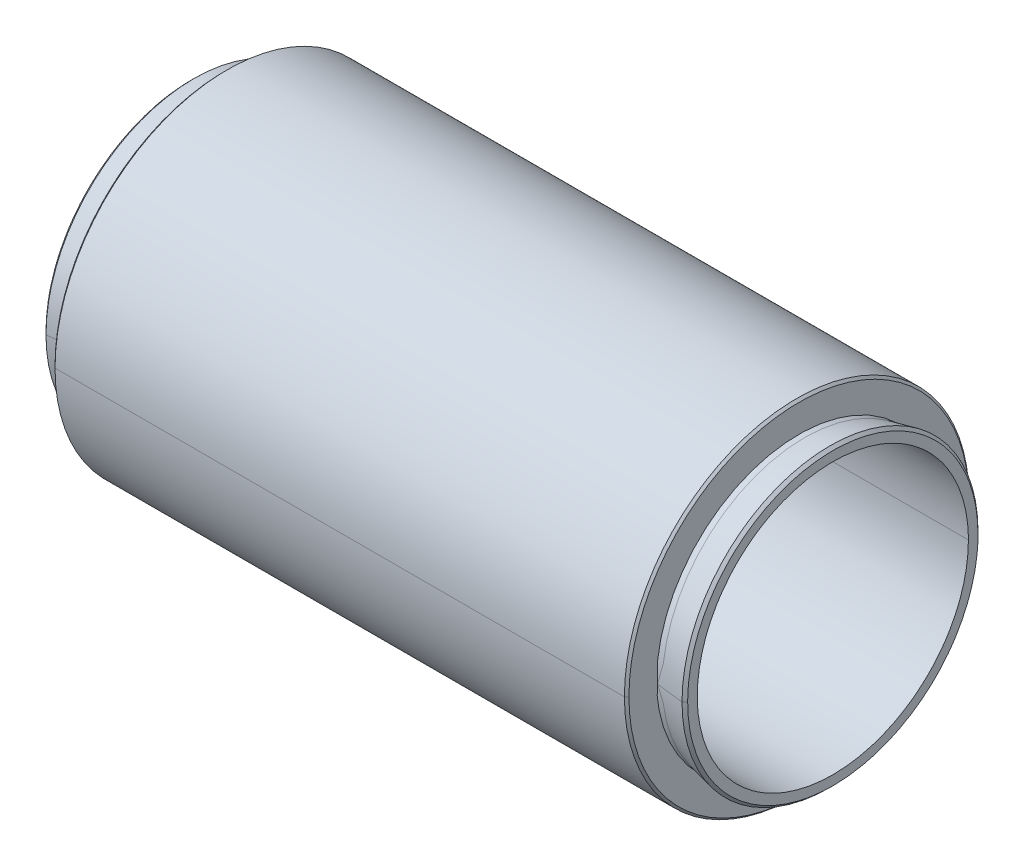
ISO-10303-21;
HEADER;
FILE_DESCRIPTION(('STEP AP214'),'2;1');
FILE_NAME('part.step','',(''),(''),'','','');
FILE_SCHEMA(('AUTOMOTIVE_DESIGN { 1 0 10303 214 1 1 1 1 }'));
ENDSEC;
DATA;
#1=APPLICATION_CONTEXT('core data for automotive mechanical design processes');
#2=APPLICATION_PROTOCOL_DEFINITION('international standard','automotive_design',2000,#1);
#3=PRODUCT_CONTEXT('',#1,'mechanical');
#4=PRODUCT('Part','Part','',(#3));
#5=PRODUCT_RELATED_PRODUCT_CATEGORY('part','',(#4));
#6=PRODUCT_DEFINITION_FORMATION('','',#4);
#7=PRODUCT_DEFINITION_CONTEXT('part definition',#1,'design');
#8=PRODUCT_DEFINITION('design','',#6,#7);
#9=PRODUCT_DEFINITION_SHAPE('','',#8);
#10=(LENGTH_UNIT() NAMED_UNIT(*) SI_UNIT(.MILLI.,.METRE.));
#11=(NAMED_UNIT(*) PLANE_ANGLE_UNIT() SI_UNIT($,.RADIAN.));
#12=(NAMED_UNIT(*) SI_UNIT($,.STERADIAN.) SOLID_ANGLE_UNIT());
#13=UNCERTAINTY_MEASURE_WITH_UNIT(LENGTH_MEASURE(1.E-05),#10,'distance_accuracy_value','');
#14=(GEOMETRIC_REPRESENTATION_CONTEXT(3) GLOBAL_UNCERTAINTY_ASSIGNED_CONTEXT((#13)) GLOBAL_UNIT_ASSIGNED_CONTEXT((#10,
#11,#12)) REPRESENTATION_CONTEXT('',''));
#15=CARTESIAN_POINT('',(0.,0.,0.));
#16=DIRECTION('',(0.,0.,1.));
#17=DIRECTION('',(1.,0.,0.));
#18=AXIS2_PLACEMENT_3D('',#15,#16,#17);
#19=CARTESIAN_POINT('',(3.8,0.,0.));
#20=DIRECTION('',(-1.,0.,0.));
#21=DIRECTION('',(0.,0.,1.));
#22=AXIS2_PLACEMENT_3D('',#19,#20,#21);
#23=CYLINDRICAL_SURFACE('',#22,13.1);
#24=CARTESIAN_POINT('',(1.3,0.,13.1));
#25=DIRECTION('',(1.,0.,0.));
#26=VECTOR('',#25,1.);
#27=LINE('',#24,#26);
#28=CARTESIAN_POINT('',(1.09099019513593,0.,12.8090098048641));
#29=VERTEX_POINT('',#28);
#30=CARTESIAN_POINT('',(3.55,0.,13.1));
#31=VERTEX_POINT('',#30);
#32=EDGE_CURVE('E115',#29,#31,#27,.T.);
#33=ORIENTED_EDGE('',*,*,#32,.F.);
#34=CARTESIAN_POINT('',(1.3,0.,0.));
#35=DIRECTION('',(-1.,0.,0.));
#36=DIRECTION('',(0.,0.,-1.));
#37=AXIS2_PLACEMENT_3D('',#34,#35,#36);
#38=CIRCLE('',#37,12.6);
#39=CARTESIAN_POINT('',(1.09099019513593,0.,-12.8090098048641));
#40=VERTEX_POINT('',#39);
#41=EDGE_CURVE('E109',#40,#29,#38,.T.);
#42=ORIENTED_EDGE('',*,*,#41,.F.);
#43=CARTESIAN_POINT('',(3.55000000000001,0.,-13.1));
#44=DIRECTION('',(-1.,0.,0.));
#45=VECTOR('',#44,1.);
#46=LINE('',#43,#45);
#47=CARTESIAN_POINT('',(3.55,0.,-13.1));
#48=VERTEX_POINT('',#47);
#49=EDGE_CURVE('E111',#48,#40,#46,.T.);
#50=ORIENTED_EDGE('',*,*,#49,.F.);
#51=CARTESIAN_POINT('',(3.55000000000001,0.,0.));
#52=DIRECTION('',(1.,0.,0.));
#53=DIRECTION('',(0.,0.,1.));
#54=AXIS2_PLACEMENT_3D('',#51,#52,#53);
#55=CIRCLE('',#54,13.1);
#56=EDGE_CURVE('E550',#31,#48,#55,.T.);
#57=ORIENTED_EDGE('',*,*,#56,.F.);
#58=EDGE_LOOP('',(#33,#42,#50,#57));
#59=FACE_BOUND('',#58,.T.);
#60=ADVANCED_FACE('F14',(#59),#23,.T.);
#61=CARTESIAN_POINT('',(3.8,0.,0.));
#62=DIRECTION('',(-1.,0.,0.));
#63=DIRECTION('',(0.,0.,1.));
#64=AXIS2_PLACEMENT_3D('',#61,#62,#63);
#65=CYLINDRICAL_SURFACE('',#64,13.1);
#66=CARTESIAN_POINT('',(1.3,0.,0.));
#67=DIRECTION('',(-1.,0.,0.));
#68=DIRECTION('',(0.,0.,1.));
#69=AXIS2_PLACEMENT_3D('',#66,#67,#68);
#70=CIRCLE('',#69,12.6);
#71=EDGE_CURVE('E120',#29,#40,#70,.T.);
#72=ORIENTED_EDGE('',*,*,#71,.F.);
#73=ORIENTED_EDGE('',*,*,#32,.T.);
#74=CARTESIAN_POINT('',(3.55000000000001,0.,0.));
#75=DIRECTION('',(1.,0.,0.));
#76=DIRECTION('',(0.,0.,-1.));
#77=AXIS2_PLACEMENT_3D('',#74,#75,#76);
#78=CIRCLE('',#77,13.1);
#79=EDGE_CURVE('E146',#48,#31,#78,.T.);
#80=ORIENTED_EDGE('',*,*,#79,.F.);
#81=ORIENTED_EDGE('',*,*,#49,.T.);
#82=EDGE_LOOP('',(#72,#73,#80,#81));
#83=FACE_BOUND('',#82,.T.);
#84=ADVANCED_FACE('F143',(#83),#65,.T.);
#85=CARTESIAN_POINT('',(-53.,0.,0.));
#86=DIRECTION('',(1.,0.,0.));
#87=DIRECTION('',(0.,0.,-1.));
#88=AXIS2_PLACEMENT_3D('',#85,#86,#87);
#89=CYLINDRICAL_SURFACE('',#88,13.1);
#90=CARTESIAN_POINT('',(-50.5,0.,-13.1));
#91=DIRECTION('',(-1.,0.,0.));
#92=VECTOR('',#91,1.);
#93=LINE('',#90,#92);
#94=CARTESIAN_POINT('',(-50.2909901951359,0.,-12.8090098048641));
#95=VERTEX_POINT('',#94);
#96=CARTESIAN_POINT('',(-52.75,0.,-13.1));
#97=VERTEX_POINT('',#96);
#98=EDGE_CURVE('E594',#95,#97,#93,.T.);
#99=ORIENTED_EDGE('',*,*,#98,.F.);
#100=CARTESIAN_POINT('',(-50.5,0.,0.));
#101=DIRECTION('',(1.,0.,0.));
#102=DIRECTION('',(0.,0.,1.));
#103=AXIS2_PLACEMENT_3D('',#100,#101,#102);
#104=CIRCLE('',#103,12.6);
#105=CARTESIAN_POINT('',(-50.2909901951359,0.,12.8090098048641));
#106=VERTEX_POINT('',#105);
#107=EDGE_CURVE('E635',#106,#95,#104,.T.);
#108=ORIENTED_EDGE('',*,*,#107,.F.);
#109=CARTESIAN_POINT('',(-52.75,0.,13.1));
#110=DIRECTION('',(1.,0.,0.));
#111=VECTOR('',#110,1.);
#112=LINE('',#109,#111);
#113=CARTESIAN_POINT('',(-52.75,0.,13.1));
#114=VERTEX_POINT('',#113);
#115=EDGE_CURVE('E573',#114,#106,#112,.T.);
#116=ORIENTED_EDGE('',*,*,#115,.F.);
#117=CARTESIAN_POINT('',(-52.75,0.,0.));
#118=DIRECTION('',(-1.,0.,0.));
#119=DIRECTION('',(0.,0.,-1.));
#120=AXIS2_PLACEMENT_3D('',#117,#118,#119);
#121=CIRCLE('',#120,13.1);
#122=EDGE_CURVE('E464',#97,#114,#121,.T.);
#123=ORIENTED_EDGE('',*,*,#122,.F.);
#124=EDGE_LOOP('',(#99,#108,#116,#123));
#125=FACE_BOUND('',#124,.T.);
#126=ADVANCED_FACE('F609',(#125),#89,.T.);
#127=CARTESIAN_POINT('',(-53.,0.,0.));
#128=DIRECTION('',(1.,0.,0.));
#129=DIRECTION('',(0.,0.,-1.));
#130=AXIS2_PLACEMENT_3D('',#127,#128,#129);
#131=CYLINDRICAL_SURFACE('',#130,13.1);
#132=CARTESIAN_POINT('',(-50.5,0.,0.));
#133=DIRECTION('',(1.,0.,0.));
#134=DIRECTION('',(0.,0.,-1.));
#135=AXIS2_PLACEMENT_3D('',#132,#133,#134);
#136=CIRCLE('',#135,12.6);
#137=EDGE_CURVE('E26',#95,#106,#136,.T.);
#138=ORIENTED_EDGE('',*,*,#137,.F.);
#139=ORIENTED_EDGE('',*,*,#98,.T.);
#140=CARTESIAN_POINT('',(-52.75,0.,0.));
#141=DIRECTION('',(-1.,0.,0.));
#142=DIRECTION('',(0.,0.,1.));
#143=AXIS2_PLACEMENT_3D('',#140,#141,#142);
#144=CIRCLE('',#143,13.1);
#145=EDGE_CURVE('E409',#114,#97,#144,.T.);
#146=ORIENTED_EDGE('',*,*,#145,.F.);
#147=ORIENTED_EDGE('',*,*,#115,.T.);
#148=EDGE_LOOP('',(#138,#139,#146,#147));
#149=FACE_BOUND('',#148,.T.);
#150=ADVANCED_FACE('F531',(#149),#131,.T.);
#151=CARTESIAN_POINT('',(3.8,0.,0.));
#152=DIRECTION('',(-1.,0.,0.));
#153=DIRECTION('',(0.,0.,1.));
#154=AXIS2_PLACEMENT_3D('',#151,#152,#153);
#155=CONICAL_SURFACE('',#154,12.85,0.785398163397442);
#156=CARTESIAN_POINT('',(3.55000000000001,0.,13.1));
#157=DIRECTION('',(0.707106781186553,0.,-0.707106781186543));
#158=VECTOR('',#157,1.);
#159=LINE('',#156,#158);
#160=CARTESIAN_POINT('',(3.8,0.,12.85));
#161=VERTEX_POINT('',#160);
#162=EDGE_CURVE('E507',#31,#161,#159,.T.);
#163=ORIENTED_EDGE('',*,*,#162,.F.);
#164=ORIENTED_EDGE('',*,*,#56,.T.);
#165=CARTESIAN_POINT('',(3.8,0.,-12.85));
#166=DIRECTION('',(-0.707106781186553,0.,-0.707106781186543));
#167=VECTOR('',#166,1.);
#168=LINE('',#165,#167);
#169=CARTESIAN_POINT('',(3.8,0.,-12.85));
#170=VERTEX_POINT('',#169);
#171=EDGE_CURVE('E487',#170,#48,#168,.T.);
#172=ORIENTED_EDGE('',*,*,#171,.F.);
#173=CARTESIAN_POINT('',(3.8,0.,12.85));
#174=CARTESIAN_POINT('',(3.8,-1.26533680572966,12.85));
#175=CARTESIAN_POINT('',(3.8,-2.50691063790725,12.6030908531815));
#176=CARTESIAN_POINT('',(3.8,-3.74767787199967,12.3563421128084));
#177=CARTESIAN_POINT('',(3.8,-4.91748210589141,11.87185199277));
#178=CARTESIAN_POINT('',(3.8,-6.0862700542688,11.3877827810141));
#179=CARTESIAN_POINT('',(3.8,-7.13907749430189,10.6843845180877));
#180=CARTESIAN_POINT('',(3.8,-8.19097029157395,9.98159734329086));
#181=CARTESIAN_POINT('',(3.8,-9.08632213824714,9.08632213824715));
#182=CARTESIAN_POINT('',(3.8,-9.98089613414528,8.1918247173949));
#183=CARTESIAN_POINT('',(3.8,-10.6843845180877,7.1390774943019));
#184=CARTESIAN_POINT('',(3.8,-11.3872617356272,6.08724486162463));
#185=CARTESIAN_POINT('',(3.8,-11.87185199277,4.91748210589142));
#186=CARTESIAN_POINT('',(3.8,-12.3560212546479,3.74873559960612));
#187=CARTESIAN_POINT('',(3.8,-12.6030908531815,2.50691063790725));
#188=CARTESIAN_POINT('',(3.8,-12.8499458061876,1.26616453081265));
#189=CARTESIAN_POINT('',(3.8,-12.85,0.));
#190=CARTESIAN_POINT('',(3.8,-12.8500541467307,-1.26506453082778));
#191=CARTESIAN_POINT('',(3.8,-12.6030908531815,-2.50691063790725));
#192=CARTESIAN_POINT('',(3.8,-12.3563421128047,-3.7476778720176));
#193=CARTESIAN_POINT('',(3.8,-11.87185199277,-4.91748210589141));
#194=CARTESIAN_POINT('',(3.8,-11.387782781002,-6.08627005428912));
#195=CARTESIAN_POINT('',(3.8,-10.6843845180877,-7.13907749430189));
#196=CARTESIAN_POINT('',(3.8,-9.98159734327453,-8.19097029159626));
#197=CARTESIAN_POINT('',(3.8,-9.08632213824715,-9.08632213824714));
#198=CARTESIAN_POINT('',(3.8,-8.19182471738288,-9.98089613415131));
#199=CARTESIAN_POINT('',(3.8,-7.1390774943019,-10.6843845180877));
#200=CARTESIAN_POINT('',(3.8,-6.08724486164034,-11.3872617356187));
#201=CARTESIAN_POINT('',(3.8,-4.91748210589142,-11.87185199277));
#202=CARTESIAN_POINT('',(3.8,-3.74873559961538,-12.3560212546461));
#203=CARTESIAN_POINT('',(3.8,-2.50691063790725,-12.6030908531815));
#204=CARTESIAN_POINT('',(3.8,-1.26589214105138,-12.85));
#205=CARTESIAN_POINT('',(3.8,0.,-12.85));
#206=B_SPLINE_CURVE_WITH_KNOTS('',2,(#173,#174,#175,#176,#177,#178,#179,#180,#181,#182,#183,
#184,#185,#186,#187,#188,#189,#190,#191,#192,#193,#194,#195,#196,#197,#198,#199,#200,#201,#202,
#203,#204,#205),.UNSPECIFIED.,.F.,.F.,(3,2,2,2,2,2,2,2,2,2,2,2,2,2,2,2,3),(0.,0.0625,0.125,
0.1875,0.25,0.3125,0.375,0.4375,0.5,0.5625,0.625,0.6875,0.75,0.8125,0.875,0.9375,1.),.UNSPECIFIED.);
#207=EDGE_CURVE('E340',#161,#170,#206,.T.);
#208=ORIENTED_EDGE('',*,*,#207,.F.);
#209=EDGE_LOOP('',(#163,#164,#172,#208));
#210=FACE_BOUND('',#209,.T.);
#211=ADVANCED_FACE('F522',(#210),#155,.T.);
#212=CARTESIAN_POINT('',(3.8,0.,0.));
#213=DIRECTION('',(-1.,0.,0.));
#214=DIRECTION('',(0.,0.,1.));
#215=AXIS2_PLACEMENT_3D('',#212,#213,#214);
#216=CONICAL_SURFACE('',#215,12.85,0.785398163397442);
#217=ORIENTED_EDGE('',*,*,#79,.T.);
#218=ORIENTED_EDGE('',*,*,#162,.T.);
#219=CARTESIAN_POINT('',(3.8,0.,-12.85));
#220=CARTESIAN_POINT('',(3.8,1.2653368057265,-12.85));
#221=CARTESIAN_POINT('',(3.8,2.50691063790725,-12.6030908531815));
#222=CARTESIAN_POINT('',(3.8,3.74767787200766,-12.3563421128074));
#223=CARTESIAN_POINT('',(3.8,4.91748210589141,-11.87185199277));
#224=CARTESIAN_POINT('',(3.8,6.08627005428599,-11.3877827810047));
#225=CARTESIAN_POINT('',(3.8,7.1390774943019,-10.6843845180877));
#226=CARTESIAN_POINT('',(3.8,8.19097029158604,-9.98159734328076));
#227=CARTESIAN_POINT('',(3.8,9.08632213824715,-9.08632213824715));
#228=CARTESIAN_POINT('',(3.8,9.98089613414349,-8.19182471739469));
#229=CARTESIAN_POINT('',(3.8,10.6843845180877,-7.1390774943019));
#230=CARTESIAN_POINT('',(3.8,11.3872617356232,-6.0872448616335));
#231=CARTESIAN_POINT('',(3.8,11.87185199277,-4.91748210589141));
#232=CARTESIAN_POINT('',(3.8,12.3560212546458,-3.74873559961199));
#233=CARTESIAN_POINT('',(3.8,12.6030908531815,-2.50691063790725));
#234=CARTESIAN_POINT('',(3.8,12.8499458061876,-1.26616453081734));
#235=CARTESIAN_POINT('',(3.8,12.85,0.));
#236=CARTESIAN_POINT('',(3.8,12.8500541467307,1.2650645308325));
#237=CARTESIAN_POINT('',(3.8,12.6030908531815,2.50691063790725));
#238=CARTESIAN_POINT('',(3.8,12.3563421128048,3.7476778720123));
#239=CARTESIAN_POINT('',(3.8,11.87185199277,4.91748210589141));
#240=CARTESIAN_POINT('',(3.8,11.3877827810054,6.08627005428583));
#241=CARTESIAN_POINT('',(3.8,10.6843845180877,7.13907749430189));
#242=CARTESIAN_POINT('',(3.8,9.98159734327882,8.19097029158799));
#243=CARTESIAN_POINT('',(3.8,9.08632213824715,9.08632213824714));
#244=CARTESIAN_POINT('',(3.8,8.19182471740263,9.98089613413554));
#245=CARTESIAN_POINT('',(3.8,7.1390774943019,10.6843845180877));
#246=CARTESIAN_POINT('',(3.8,6.08724486164518,11.387261735618));
#247=CARTESIAN_POINT('',(3.8,4.91748210589141,11.87185199277));
#248=CARTESIAN_POINT('',(3.8,3.74873559961786,12.3560212546437));
#249=CARTESIAN_POINT('',(3.8,2.50691063790725,12.6030908531815));
#250=CARTESIAN_POINT('',(3.8,1.26589214106079,12.85));
#251=CARTESIAN_POINT('',(3.8,0.,12.85));
#252=B_SPLINE_CURVE_WITH_KNOTS('',2,(#219,#220,#221,#222,#223,#224,#225,#226,#227,#228,#229,
#230,#231,#232,#233,#234,#235,#236,#237,#238,#239,#240,#241,#242,#243,#244,#245,#246,#247,#248,
#249,#250,#251),.UNSPECIFIED.,.F.,.F.,(3,2,2,2,2,2,2,2,2,2,2,2,2,2,2,2,3),(0.,0.0625,0.125,
0.1875,0.25,0.3125,0.375,0.4375,0.5,0.5625,0.625,0.6875,0.75,0.8125,0.875,0.9375,1.),.UNSPECIFIED.);
#253=EDGE_CURVE('E477',#170,#161,#252,.T.);
#254=ORIENTED_EDGE('',*,*,#253,.F.);
#255=ORIENTED_EDGE('',*,*,#171,.T.);
#256=EDGE_LOOP('',(#217,#218,#254,#255));
#257=FACE_BOUND('',#256,.T.);
#258=ADVANCED_FACE('F445',(#257),#216,.T.);
#259=CARTESIAN_POINT('',(-52.75,0.,0.));
#260=DIRECTION('',(1.,0.,0.));
#261=DIRECTION('',(0.,0.,-1.));
#262=AXIS2_PLACEMENT_3D('',#259,#260,#261);
#263=CONICAL_SURFACE('',#262,13.1,0.785398163397438);
#264=CARTESIAN_POINT('',(-52.75,0.,-13.1));
#265=DIRECTION('',(-0.707106781186555,0.,0.70710678118654));
#266=VECTOR('',#265,1.);
#267=LINE('',#264,#266);
#268=CARTESIAN_POINT('',(-53.,0.,-12.85));
#269=VERTEX_POINT('',#268);
#270=EDGE_CURVE('E420',#97,#269,#267,.T.);
#271=ORIENTED_EDGE('',*,*,#270,.F.);
#272=ORIENTED_EDGE('',*,*,#122,.T.);
#273=CARTESIAN_POINT('',(-53.,0.,12.85));
#274=DIRECTION('',(0.707106781186555,0.,0.70710678118654));
#275=VECTOR('',#274,1.);
#276=LINE('',#273,#275);
#277=CARTESIAN_POINT('',(-53.,0.,12.85));
#278=VERTEX_POINT('',#277);
#279=EDGE_CURVE('E398',#278,#114,#276,.T.);
#280=ORIENTED_EDGE('',*,*,#279,.F.);
#281=CARTESIAN_POINT('',(-53.,0.,-12.85));
#282=CARTESIAN_POINT('',(-53.,-1.26533680572966,-12.85));
#283=CARTESIAN_POINT('',(-53.,-2.50691063790725,-12.6030908531815));
#284=CARTESIAN_POINT('',(-53.,-3.74767787200702,-12.3563421128069));
#285=CARTESIAN_POINT('',(-53.,-4.9174821058914,-11.87185199277));
#286=CARTESIAN_POINT('',(-53.,-6.0862700542724,-11.387782781011));
#287=CARTESIAN_POINT('',(-53.,-7.13907749430189,-10.6843845180877));
#288=CARTESIAN_POINT('',(-53.,-8.19097029157193,-9.98159734329286));
#289=CARTESIAN_POINT('',(-53.,-9.08632213824714,-9.08632213824714));
#290=CARTESIAN_POINT('',(-53.,-9.98089613414527,-8.19182471739489));
#291=CARTESIAN_POINT('',(-53.,-10.6843845180877,-7.13907749430189));
#292=CARTESIAN_POINT('',(-53.,-11.3872617356272,-6.08724486162462));
#293=CARTESIAN_POINT('',(-53.,-11.87185199277,-4.91748210589141));
#294=CARTESIAN_POINT('',(-53.,-12.3560212546479,-3.74873559960611));
#295=CARTESIAN_POINT('',(-53.,-12.6030908531815,-2.50691063790725));
#296=CARTESIAN_POINT('',(-53.,-12.8499458061876,-1.26616453081265));
#297=CARTESIAN_POINT('',(-53.,-12.85,0.));
#298=CARTESIAN_POINT('',(-53.,-12.8500541467306,1.26506453082777));
#299=CARTESIAN_POINT('',(-53.,-12.6030908531815,2.50691063790725));
#300=CARTESIAN_POINT('',(-53.,-12.3563421128065,3.74767787200833));
#301=CARTESIAN_POINT('',(-53.,-11.87185199277,4.91748210589141));
#302=CARTESIAN_POINT('',(-53.,-11.387782781004,6.08627005428912));
#303=CARTESIAN_POINT('',(-53.,-10.6843845180877,7.13907749430188));
#304=CARTESIAN_POINT('',(-53.,-9.98159734326851,8.19097029160227));
#305=CARTESIAN_POINT('',(-53.,-9.08632213824714,9.08632213824713));
#306=CARTESIAN_POINT('',(-53.,-8.19182471738288,9.9808961341513));
#307=CARTESIAN_POINT('',(-53.,-7.13907749430189,10.6843845180877));
#308=CARTESIAN_POINT('',(-53.,-6.08724486164033,11.3872617356187));
#309=CARTESIAN_POINT('',(-53.,-4.91748210589141,11.87185199277));
#310=CARTESIAN_POINT('',(-53.,-3.74873559961538,12.356021254646));
#311=CARTESIAN_POINT('',(-53.,-2.50691063790725,12.6030908531815));
#312=CARTESIAN_POINT('',(-53.,-1.26589214105139,12.85));
#313=CARTESIAN_POINT('',(-53.,0.,12.85));
#314=B_SPLINE_CURVE_WITH_KNOTS('',2,(#281,#282,#283,#284,#285,#286,#287,#288,#289,#290,#291,
#292,#293,#294,#295,#296,#297,#298,#299,#300,#301,#302,#303,#304,#305,#306,#307,#308,#309,#310,
#311,#312,#313),.UNSPECIFIED.,.F.,.F.,(3,2,2,2,2,2,2,2,2,2,2,2,2,2,2,2,3),(0.,0.0625,0.125,
0.1875,0.25,0.3125,0.375,0.4375,0.5,0.5625,0.625,0.6875,0.75,0.8125,0.875,0.9375,1.),.UNSPECIFIED.);
#315=EDGE_CURVE('E253',#269,#278,#314,.T.);
#316=ORIENTED_EDGE('',*,*,#315,.F.);
#317=EDGE_LOOP('',(#271,#272,#280,#316));
#318=FACE_BOUND('',#317,.T.);
#319=ADVANCED_FACE('F436',(#318),#263,.T.);
#320=CARTESIAN_POINT('',(-52.75,0.,0.));
#321=DIRECTION('',(1.,0.,0.));
#322=DIRECTION('',(0.,0.,-1.));
#323=AXIS2_PLACEMENT_3D('',#320,#321,#322);
#324=CONICAL_SURFACE('',#323,13.1,0.785398163397438);
#325=ORIENTED_EDGE('',*,*,#145,.T.);
#326=ORIENTED_EDGE('',*,*,#270,.T.);
#327=CARTESIAN_POINT('',(-53.,0.,12.85));
#328=CARTESIAN_POINT('',(-53.,1.26533680573603,12.85));
#329=CARTESIAN_POINT('',(-53.,2.50691063790725,12.6030908531815));
#330=CARTESIAN_POINT('',(-53.,3.74767787200527,12.356342112806));
#331=CARTESIAN_POINT('',(-53.,4.9174821058914,11.87185199277));
#332=CARTESIAN_POINT('',(-53.,6.08627005427912,11.3877827810099));
#333=CARTESIAN_POINT('',(-53.,7.13907749430189,10.6843845180877));
#334=CARTESIAN_POINT('',(-53.,8.19097029158804,9.98159734327874));
#335=CARTESIAN_POINT('',(-53.,9.08632213824714,9.08632213824714));
#336=CARTESIAN_POINT('',(-53.,9.98089613414749,8.19182471739067));
#337=CARTESIAN_POINT('',(-53.,10.6843845180877,7.13907749430189));
#338=CARTESIAN_POINT('',(-53.,11.387261735619,6.08724486163775));
#339=CARTESIAN_POINT('',(-53.,11.87185199277,4.91748210589141));
#340=CARTESIAN_POINT('',(-53.,12.3560212546436,3.74873559962318));
#341=CARTESIAN_POINT('',(-53.,12.6030908531815,2.50691063790725));
#342=CARTESIAN_POINT('',(-53.,12.8499458061876,1.26616453081734));
#343=CARTESIAN_POINT('',(-53.,12.85,0.));
#344=CARTESIAN_POINT('',(-53.,12.8500541467306,-1.265064530833));
#345=CARTESIAN_POINT('',(-53.,12.6030908531815,-2.50691063790725));
#346=CARTESIAN_POINT('',(-53.,12.3563421128046,-3.74767787201277));
#347=CARTESIAN_POINT('',(-53.,11.87185199277,-4.9174821058914));
#348=CARTESIAN_POINT('',(-53.,11.3877827810054,-6.08627005428583));
#349=CARTESIAN_POINT('',(-53.,10.6843845180877,-7.13907749430189));
#350=CARTESIAN_POINT('',(-53.,9.98159734327881,-8.19097029158798));
#351=CARTESIAN_POINT('',(-53.,9.08632213824714,-9.08632213824714));
#352=CARTESIAN_POINT('',(-53.,8.19182471739661,-9.98089613414155));
#353=CARTESIAN_POINT('',(-53.,7.13907749430189,-10.6843845180877));
#354=CARTESIAN_POINT('',(-53.,6.08724486163569,-11.3872617356224));
#355=CARTESIAN_POINT('',(-53.,4.91748210589141,-11.87185199277));
#356=CARTESIAN_POINT('',(-53.,3.74873559961594,-12.3560212546441));
#357=CARTESIAN_POINT('',(-53.,2.50691063790725,-12.6030908531815));
#358=CARTESIAN_POINT('',(-53.,1.26589214106079,-12.85));
#359=CARTESIAN_POINT('',(-53.,0.,-12.85));
#360=B_SPLINE_CURVE_WITH_KNOTS('',2,(#327,#328,#329,#330,#331,#332,#333,#334,#335,#336,#337,
#338,#339,#340,#341,#342,#343,#344,#345,#346,#347,#348,#349,#350,#351,#352,#353,#354,#355,#356,
#357,#358,#359),.UNSPECIFIED.,.F.,.F.,(3,2,2,2,2,2,2,2,2,2,2,2,2,2,2,2,3),(0.,0.0625,0.125,
0.1875,0.25,0.3125,0.375,0.4375,0.5,0.5625,0.625,0.6875,0.75,0.8125,0.875,0.9375,1.),.UNSPECIFIED.);
#361=EDGE_CURVE('E387',#278,#269,#360,.T.);
#362=ORIENTED_EDGE('',*,*,#361,.F.);
#363=ORIENTED_EDGE('',*,*,#279,.T.);
#364=EDGE_LOOP('',(#325,#326,#362,#363));
#365=FACE_BOUND('',#364,.T.);
#366=ADVANCED_FACE('F354',(#365),#324,.T.);
#367=CARTESIAN_POINT('',(3.8,0.,0.));
#368=DIRECTION('',(1.,0.,0.));
#369=DIRECTION('',(0.,1.,0.));
#370=AXIS2_PLACEMENT_3D('',#367,#368,#369);
#371=PLANE('',#370);
#372=CARTESIAN_POINT('',(3.8,0.,12.));
#373=CARTESIAN_POINT('',(3.8,1.18161910863126,12.));
#374=CARTESIAN_POINT('',(3.8,2.34108386419354,11.7694233648388));
#375=CARTESIAN_POINT('',(3.8,3.49974201692428,11.5390071345246));
#376=CARTESIAN_POINT('',(3.8,4.59220118838108,11.0865543901354));
#377=CARTESIAN_POINT('',(3.8,5.68364407303178,10.634522550954));
#378=CARTESIAN_POINT('',(3.8,6.66684279623522,9.97763534763055));
#379=CARTESIAN_POINT('',(3.8,7.64912687483852,9.32135922965457));
#380=CARTESIAN_POINT('',(3.8,8.48528137423857,8.48528137423857));
#381=CARTESIAN_POINT('',(3.8,9.32065802052022,7.64998130064103));
#382=CARTESIAN_POINT('',(3.8,9.97763534763054,6.66684279623523));
#383=CARTESIAN_POINT('',(3.8,10.6340015055603,5.6846188803994));
#384=CARTESIAN_POINT('',(3.8,11.0865543901354,4.59220118838108));
#385=CARTESIAN_POINT('',(3.8,11.5386862763553,3.50079974455665));
#386=CARTESIAN_POINT('',(3.8,11.7694233648388,2.34108386419354));
#387=CARTESIAN_POINT('',(3.8,11.9999458045191,1.18244683780793));
#388=CARTESIAN_POINT('',(3.8,12.,0.));
#389=CARTESIAN_POINT('',(3.8,12.0000541450642,-1.18134683779745));
#390=CARTESIAN_POINT('',(3.8,11.7694233648388,-2.34108386419354));
#391=CARTESIAN_POINT('',(3.8,11.5390071345214,-3.49974201693632));
#392=CARTESIAN_POINT('',(3.8,11.0865543901354,-4.59220118838108));
#393=CARTESIAN_POINT('',(3.8,10.6345225509474,-5.68364407304338));
#394=CARTESIAN_POINT('',(3.8,9.97763534763055,-6.66684279623522));
#395=CARTESIAN_POINT('',(3.8,9.32135922964729,-7.64912687484767));
#396=CARTESIAN_POINT('',(3.8,8.48528137423857,-8.48528137423857));
#397=CARTESIAN_POINT('',(3.8,7.64998130063164,-9.32065802052774));
#398=CARTESIAN_POINT('',(3.8,6.66684279623523,-9.97763534763054));
#399=CARTESIAN_POINT('',(3.8,5.68461888039449,-10.6340015055623));
#400=CARTESIAN_POINT('',(3.8,4.59220118838109,-11.0865543901354));
#401=CARTESIAN_POINT('',(3.8,3.50079974455709,-11.5386862763551));
#402=CARTESIAN_POINT('',(3.8,2.34108386419354,-11.7694233648388));
#403=CARTESIAN_POINT('',(3.8,1.18217444397587,-12.));
#404=CARTESIAN_POINT('',(3.8,0.,-12.));
#405=B_SPLINE_CURVE_WITH_KNOTS('',2,(#372,#373,#374,#375,#376,#377,#378,#379,#380,#381,#382,
#383,#384,#385,#386,#387,#388,#389,#390,#391,#392,#393,#394,#395,#396,#397,#398,#399,#400,#401,
#402,#403,#404),.UNSPECIFIED.,.F.,.F.,(3,2,2,2,2,2,2,2,2,2,2,2,2,2,2,2,3),(0.,0.0625,0.125,
0.1875,0.25,0.3125,0.375,0.4375,0.5,0.5625,0.625,0.6875,0.75,0.8125,0.875,0.9375,1.),.UNSPECIFIED.);
#406=CARTESIAN_POINT('',(3.8,0.,12.));
#407=VERTEX_POINT('',#406);
#408=CARTESIAN_POINT('',(3.8,0.,-12.));
#409=VERTEX_POINT('',#408);
#410=EDGE_CURVE('E299',#407,#409,#405,.T.);
#411=ORIENTED_EDGE('',*,*,#410,.T.);
#412=CARTESIAN_POINT('',(3.8,0.,-12.));
#413=CARTESIAN_POINT('',(3.8,-1.18161910863655,-12.));
#414=CARTESIAN_POINT('',(3.8,-2.34108386419354,-11.7694233648388));
#415=CARTESIAN_POINT('',(3.8,-3.49974201693808,-11.5390071345208));
#416=CARTESIAN_POINT('',(3.8,-4.59220118838108,-11.0865543901354));
#417=CARTESIAN_POINT('',(3.8,-5.68364407305142,-10.634522550944));
#418=CARTESIAN_POINT('',(3.8,-6.66684279623523,-9.97763534763054));
#419=CARTESIAN_POINT('',(3.8,-7.64912687484216,-9.32135922964908));
#420=CARTESIAN_POINT('',(3.8,-8.48528137423857,-8.48528137423857));
#421=CARTESIAN_POINT('',(3.8,-9.32065802051448,-7.64998130064863));
#422=CARTESIAN_POINT('',(3.8,-9.97763534763054,-6.66684279623523));
#423=CARTESIAN_POINT('',(3.8,-10.6340015055561,-5.68461888040662));
#424=CARTESIAN_POINT('',(3.8,-11.0865543901354,-4.59220118838108));
#425=CARTESIAN_POINT('',(3.8,-11.538686276353,-3.50079974456497));
#426=CARTESIAN_POINT('',(3.8,-11.7694233648388,-2.34108386419354));
#427=CARTESIAN_POINT('',(3.8,-11.9999458045191,-1.18244683781106));
#428=CARTESIAN_POINT('',(3.8,-12.,0.));
#429=CARTESIAN_POINT('',(3.8,-12.0000541450642,1.18134683780054));
#430=CARTESIAN_POINT('',(3.8,-11.7694233648388,2.34108386419354));
#431=CARTESIAN_POINT('',(3.8,-11.5390071345191,3.49974201694461));
#432=CARTESIAN_POINT('',(3.8,-11.0865543901354,4.59220118838108));
#433=CARTESIAN_POINT('',(3.8,-10.6345225509432,5.68364407305071));
#434=CARTESIAN_POINT('',(3.8,-9.97763534763054,6.66684279623522));
#435=CARTESIAN_POINT('',(3.8,-9.32135922964896,7.64912687484414));
#436=CARTESIAN_POINT('',(3.8,-8.48528137423857,8.48528137423857));
#437=CARTESIAN_POINT('',(3.8,-7.64998130064689,9.32065802051436));
#438=CARTESIAN_POINT('',(3.8,-6.66684279623523,9.97763534763054));
#439=CARTESIAN_POINT('',(3.8,-5.68461888040743,10.6340015055569));
#440=CARTESIAN_POINT('',(3.8,-4.59220118838108,11.0865543901354));
#441=CARTESIAN_POINT('',(3.8,-3.50079974456284,11.5386862763528));
#442=CARTESIAN_POINT('',(3.8,-2.34108386419354,11.7694233648388));
#443=CARTESIAN_POINT('',(3.8,-1.18217444398164,12.));
#444=CARTESIAN_POINT('',(3.8,0.,12.));
#445=B_SPLINE_CURVE_WITH_KNOTS('',2,(#412,#413,#414,#415,#416,#417,#418,#419,#420,#421,#422,
#423,#424,#425,#426,#427,#428,#429,#430,#431,#432,#433,#434,#435,#436,#437,#438,#439,#440,#441,
#442,#443,#444),.UNSPECIFIED.,.F.,.F.,(3,2,2,2,2,2,2,2,2,2,2,2,2,2,2,2,3),(0.,0.0625,0.125,
0.1875,0.25,0.3125,0.375,0.4375,0.5,0.5625,0.625,0.6875,0.75,0.8125,0.875,0.9375,1.),.UNSPECIFIED.);
#446=EDGE_CURVE('E220',#409,#407,#445,.T.);
#447=ORIENTED_EDGE('',*,*,#446,.T.);
#448=EDGE_LOOP('',(#411,#447));
#449=FACE_BOUND('',#448,.T.);
#450=ORIENTED_EDGE('',*,*,#207,.T.);
#451=ORIENTED_EDGE('',*,*,#253,.T.);
#452=EDGE_LOOP('',(#450,#451));
#453=FACE_BOUND('',#452,.T.);
#454=ADVANCED_FACE('F345',(#449,#453),#371,.T.);
#455=CARTESIAN_POINT('',(-53.,0.,0.));
#456=DIRECTION('',(1.,0.,0.));
#457=DIRECTION('',(0.,0.,-1.));
#458=AXIS2_PLACEMENT_3D('',#455,#456,#457);
#459=CYLINDRICAL_SURFACE('',#458,12.);
#460=CARTESIAN_POINT('',(-53.,0.,-12.));
#461=CARTESIAN_POINT('',(-53.,1.18161910863655,-12.));
#462=CARTESIAN_POINT('',(-53.,2.34108386419354,-11.7694233648388));
#463=CARTESIAN_POINT('',(-53.,3.49974201693808,-11.5390071345208));
#464=CARTESIAN_POINT('',(-53.,4.59220118838108,-11.0865543901354));
#465=CARTESIAN_POINT('',(-53.,5.68364407305142,-10.634522550944));
#466=CARTESIAN_POINT('',(-53.,6.66684279623523,-9.97763534763054));
#467=CARTESIAN_POINT('',(-53.,7.64912687484216,-9.32135922964908));
#468=CARTESIAN_POINT('',(-53.,8.48528137423857,-8.48528137423857));
#469=CARTESIAN_POINT('',(-53.,9.32065802051448,-7.64998130064863));
#470=CARTESIAN_POINT('',(-53.,9.97763534763054,-6.66684279623523));
#471=CARTESIAN_POINT('',(-53.,10.6340015055561,-5.68461888040662));
#472=CARTESIAN_POINT('',(-53.,11.0865543901354,-4.59220118838108));
#473=CARTESIAN_POINT('',(-53.,11.538686276353,-3.50079974456497));
#474=CARTESIAN_POINT('',(-53.,11.7694233648388,-2.34108386419354));
#475=CARTESIAN_POINT('',(-53.,11.9999458045191,-1.18244683781106));
#476=CARTESIAN_POINT('',(-53.,12.,0.));
#477=CARTESIAN_POINT('',(-53.,12.0000541450642,1.18134683780054));
#478=CARTESIAN_POINT('',(-53.,11.7694233648388,2.34108386419354));
#479=CARTESIAN_POINT('',(-53.,11.5390071345191,3.49974201694461));
#480=CARTESIAN_POINT('',(-53.,11.0865543901354,4.59220118838108));
#481=CARTESIAN_POINT('',(-53.,10.6345225509432,5.68364407305071));
#482=CARTESIAN_POINT('',(-53.,9.97763534763054,6.66684279623522));
#483=CARTESIAN_POINT('',(-53.,9.32135922964896,7.64912687484414));
#484=CARTESIAN_POINT('',(-53.,8.48528137423857,8.48528137423857));
#485=CARTESIAN_POINT('',(-53.,7.64998130064689,9.32065802051436));
#486=CARTESIAN_POINT('',(-53.,6.66684279623523,9.97763534763054));
#487=CARTESIAN_POINT('',(-53.,5.68461888040743,10.6340015055569));
#488=CARTESIAN_POINT('',(-53.,4.59220118838108,11.0865543901354));
#489=CARTESIAN_POINT('',(-53.,3.50079974456284,11.5386862763528));
#490=CARTESIAN_POINT('',(-53.,2.34108386419354,11.7694233648388));
#491=CARTESIAN_POINT('',(-53.,1.18217444398164,12.));
#492=CARTESIAN_POINT('',(-53.,0.,12.));
#493=B_SPLINE_CURVE_WITH_KNOTS('',2,(#460,#461,#462,#463,#464,#465,#466,#467,#468,#469,#470,
#471,#472,#473,#474,#475,#476,#477,#478,#479,#480,#481,#482,#483,#484,#485,#486,#487,#488,#489,
#490,#491,#492),.UNSPECIFIED.,.F.,.F.,(3,2,2,2,2,2,2,2,2,2,2,2,2,2,2,2,3),(0.,0.0625,0.125,
0.1875,0.25,0.3125,0.375,0.4375,0.5,0.5625,0.625,0.6875,0.75,0.8125,0.875,0.9375,1.),.UNSPECIFIED.);
#494=CARTESIAN_POINT('',(-53.,0.,-12.));
#495=VERTEX_POINT('',#494);
#496=CARTESIAN_POINT('',(-53.,0.,12.));
#497=VERTEX_POINT('',#496);
#498=EDGE_CURVE('E318',#495,#497,#493,.T.);
#499=ORIENTED_EDGE('',*,*,#498,.F.);
#500=CARTESIAN_POINT('',(-53.,0.,-12.));
#501=DIRECTION('',(1.,0.,0.));
#502=VECTOR('',#501,1.);
#503=LINE('',#500,#502);
#504=EDGE_CURVE('E209',#495,#409,#503,.T.);
#505=ORIENTED_EDGE('',*,*,#504,.T.);
#506=ORIENTED_EDGE('',*,*,#410,.F.);
#507=CARTESIAN_POINT('',(3.8,0.,12.));
#508=DIRECTION('',(-1.,0.,0.));
#509=VECTOR('',#508,1.);
#510=LINE('',#507,#509);
#511=EDGE_CURVE('E230',#407,#497,#510,.T.);
#512=ORIENTED_EDGE('',*,*,#511,.T.);
#513=EDGE_LOOP('',(#499,#505,#506,#512));
#514=FACE_BOUND('',#513,.T.);
#515=ADVANCED_FACE('F267',(#514),#459,.F.);
#516=CARTESIAN_POINT('',(-53.,0.,0.));
#517=DIRECTION('',(-1.,0.,0.));
#518=DIRECTION('',(0.,0.,1.));
#519=AXIS2_PLACEMENT_3D('',#516,#517,#518);
#520=PLANE('',#519);
#521=ORIENTED_EDGE('',*,*,#498,.T.);
#522=CARTESIAN_POINT('',(-53.,0.,12.));
#523=CARTESIAN_POINT('',(-53.,-1.18161910863126,12.));
#524=CARTESIAN_POINT('',(-53.,-2.34108386419354,11.7694233648388));
#525=CARTESIAN_POINT('',(-53.,-3.49974201692428,11.5390071345246));
#526=CARTESIAN_POINT('',(-53.,-4.59220118838108,11.0865543901354));
#527=CARTESIAN_POINT('',(-53.,-5.68364407303178,10.634522550954));
#528=CARTESIAN_POINT('',(-53.,-6.66684279623522,9.97763534763055));
#529=CARTESIAN_POINT('',(-53.,-7.64912687483852,9.32135922965457));
#530=CARTESIAN_POINT('',(-53.,-8.48528137423857,8.48528137423857));
#531=CARTESIAN_POINT('',(-53.,-9.32065802052022,7.64998130064103));
#532=CARTESIAN_POINT('',(-53.,-9.97763534763054,6.66684279623523));
#533=CARTESIAN_POINT('',(-53.,-10.6340015055603,5.6846188803994));
#534=CARTESIAN_POINT('',(-53.,-11.0865543901354,4.59220118838108));
#535=CARTESIAN_POINT('',(-53.,-11.5386862763553,3.50079974455665));
#536=CARTESIAN_POINT('',(-53.,-11.7694233648388,2.34108386419354));
#537=CARTESIAN_POINT('',(-53.,-11.9999458045191,1.18244683780793));
#538=CARTESIAN_POINT('',(-53.,-12.,0.));
#539=CARTESIAN_POINT('',(-53.,-12.0000541450642,-1.18134683779745));
#540=CARTESIAN_POINT('',(-53.,-11.7694233648388,-2.34108386419354));
#541=CARTESIAN_POINT('',(-53.,-11.5390071345214,-3.49974201693632));
#542=CARTESIAN_POINT('',(-53.,-11.0865543901354,-4.59220118838108));
#543=CARTESIAN_POINT('',(-53.,-10.6345225509474,-5.68364407304338));
#544=CARTESIAN_POINT('',(-53.,-9.97763534763055,-6.66684279623522));
#545=CARTESIAN_POINT('',(-53.,-9.32135922964729,-7.64912687484767));
#546=CARTESIAN_POINT('',(-53.,-8.48528137423857,-8.48528137423857));
#547=CARTESIAN_POINT('',(-53.,-7.64998130063164,-9.32065802052774));
#548=CARTESIAN_POINT('',(-53.,-6.66684279623523,-9.97763534763054));
#549=CARTESIAN_POINT('',(-53.,-5.68461888039449,-10.6340015055623));
#550=CARTESIAN_POINT('',(-53.,-4.59220118838109,-11.0865543901354));
#551=CARTESIAN_POINT('',(-53.,-3.50079974455709,-11.5386862763551));
#552=CARTESIAN_POINT('',(-53.,-2.34108386419354,-11.7694233648388));
#553=CARTESIAN_POINT('',(-53.,-1.18217444397587,-12.));
#554=CARTESIAN_POINT('',(-53.,0.,-12.));
#555=B_SPLINE_CURVE_WITH_KNOTS('',2,(#522,#523,#524,#525,#526,#527,#528,#529,#530,#531,#532,
#533,#534,#535,#536,#537,#538,#539,#540,#541,#542,#543,#544,#545,#546,#547,#548,#549,#550,#551,
#552,#553,#554),.UNSPECIFIED.,.F.,.F.,(3,2,2,2,2,2,2,2,2,2,2,2,2,2,2,2,3),(0.,0.0625,0.125,
0.1875,0.25,0.3125,0.375,0.4375,0.5,0.5625,0.625,0.6875,0.75,0.8125,0.875,0.9375,1.),.UNSPECIFIED.);
#556=EDGE_CURVE('E121',#497,#495,#555,.T.);
#557=ORIENTED_EDGE('',*,*,#556,.T.);
#558=EDGE_LOOP('',(#521,#557));
#559=FACE_BOUND('',#558,.T.);
#560=ORIENTED_EDGE('',*,*,#315,.T.);
#561=ORIENTED_EDGE('',*,*,#361,.T.);
#562=EDGE_LOOP('',(#560,#561));
#563=FACE_BOUND('',#562,.T.);
#564=ADVANCED_FACE('F258',(#559,#563),#520,.T.);
#565=CARTESIAN_POINT('',(-53.,0.,0.));
#566=DIRECTION('',(1.,0.,0.));
#567=DIRECTION('',(0.,0.,-1.));
#568=AXIS2_PLACEMENT_3D('',#565,#566,#567);
#569=CYLINDRICAL_SURFACE('',#568,12.);
#570=ORIENTED_EDGE('',*,*,#511,.F.);
#571=ORIENTED_EDGE('',*,*,#446,.F.);
#572=ORIENTED_EDGE('',*,*,#504,.F.);
#573=ORIENTED_EDGE('',*,*,#556,.F.);
#574=EDGE_LOOP('',(#570,#571,#572,#573));
#575=FACE_BOUND('',#574,.T.);
#576=ADVANCED_FACE('F191',(#575),#569,.F.);
#577=CARTESIAN_POINT('',(1.3,0.,0.));
#578=DIRECTION('',(-1.,0.,0.));
#579=DIRECTION('',(0.,0.,1.));
#580=AXIS2_PLACEMENT_3D('',#577,#578,#579);
#581=CYLINDRICAL_SURFACE('',#580,12.6);
#582=ORIENTED_EDGE('',*,*,#41,.T.);
#583=CARTESIAN_POINT('',(0.8,0.,-12.6));
#584=CARTESIAN_POINT('',(0.8,-1.24071395369859,-12.6));
#585=CARTESIAN_POINT('',(0.8,-2.45813805740322,-12.3578945330807));
#586=CARTESIAN_POINT('',(0.8,-3.67475556169103,-12.1159494721595));
#587=CARTESIAN_POINT('',(0.8,-4.82181124780013,-11.6408821096422));
#588=CARTESIAN_POINT('',(0.8,-5.96785064804092,-11.1662356545428));
#589=CARTESIAN_POINT('',(0.8,-7.00018493604699,-10.4765171150121));
#590=CARTESIAN_POINT('',(0.8,-8.03160458080297,-9.78740966281412));
#591=CARTESIAN_POINT('',(0.8,-8.9095454429505,-8.9095454429505));
#592=CARTESIAN_POINT('',(0.8,-9.78670845368953,-8.03245900659069));
#593=CARTESIAN_POINT('',(0.8,-10.4765171150121,-7.00018493604699));
#594=CARTESIAN_POINT('',(0.8,-11.1657146091466,-5.96882545541248));
#595=CARTESIAN_POINT('',(0.8,-11.6408821096422,-4.82181124780013));
#596=CARTESIAN_POINT('',(0.8,-12.1156286139892,-3.67581328932779));
#597=CARTESIAN_POINT('',(0.8,-12.3578945330807,-2.45813805740322));
#598=CARTESIAN_POINT('',(0.8,-12.5999458057208,-1.24154167993917));
#599=CARTESIAN_POINT('',(0.8,-12.6,0.));
#600=CARTESIAN_POINT('',(0.8,-12.6000541462633,1.24044167993428));
#601=CARTESIAN_POINT('',(0.8,-12.3578945330807,2.45813805740322));
#602=CARTESIAN_POINT('',(0.8,-12.1159494721597,3.67475556169295));
#603=CARTESIAN_POINT('',(0.8,-11.6408821096422,4.82181124780013));
#604=CARTESIAN_POINT('',(0.8,-11.1662356545391,5.96785064804742));
#605=CARTESIAN_POINT('',(0.8,-10.4765171150121,7.00018493604698));
#606=CARTESIAN_POINT('',(0.8,-9.78740966281221,8.03160458080488));
#607=CARTESIAN_POINT('',(0.8,-8.9095454429505,8.9095454429505));
#608=CARTESIAN_POINT('',(0.8,-8.03245900659258,9.78670845368763));
#609=CARTESIAN_POINT('',(0.8,-7.00018493604699,10.4765171150121));
#610=CARTESIAN_POINT('',(0.8,-5.96882545541013,11.1657146091488));
#611=CARTESIAN_POINT('',(0.8,-4.82181124780013,11.6408821096422));
#612=CARTESIAN_POINT('',(0.8,-3.67581328931815,12.115628613992));
#613=CARTESIAN_POINT('',(0.8,-2.45813805740322,12.3578945330807));
#614=CARTESIAN_POINT('',(0.8,-1.24126928903595,12.6));
#615=CARTESIAN_POINT('',(0.8,0.,12.6));
#616=B_SPLINE_CURVE_WITH_KNOTS('',2,(#583,#584,#585,#586,#587,#588,#589,#590,#591,#592,#593,
#594,#595,#596,#597,#598,#599,#600,#601,#602,#603,#604,#605,#606,#607,#608,#609,#610,#611,#612,
#613,#614,#615),.UNSPECIFIED.,.F.,.F.,(3,2,2,2,2,2,2,2,2,2,2,2,2,2,2,2,3),(0.,0.0625,0.125,
0.1875,0.25,0.3125,0.375,0.4375,0.5,0.5625,0.625,0.6875,0.75,0.8125,0.875,0.9375,1.),.UNSPECIFIED.);
#617=EDGE_CURVE('E102',#40,#29,#616,.T.);
#618=ORIENTED_EDGE('',*,*,#617,.F.);
#619=EDGE_LOOP('',(#582,#618));
#620=FACE_BOUND('',#619,.T.);
#621=ADVANCED_FACE('F136',(#620),#581,.T.);
#622=CARTESIAN_POINT('',(1.3,0.,0.));
#623=DIRECTION('',(-1.,0.,0.));
#624=DIRECTION('',(0.,0.,1.));
#625=AXIS2_PLACEMENT_3D('',#622,#623,#624);
#626=CYLINDRICAL_SURFACE('',#625,12.6);
#627=CARTESIAN_POINT('',(0.8,0.,12.6));
#628=CARTESIAN_POINT('',(0.8,1.24071395370115,12.6));
#629=CARTESIAN_POINT('',(0.8,2.45813805740322,12.3578945330807));
#630=CARTESIAN_POINT('',(0.8,3.67475556169963,12.1159494721573));
#631=CARTESIAN_POINT('',(0.8,4.82181124780013,11.6408821096422));
#632=CARTESIAN_POINT('',(0.8,5.96785064804613,11.1662356545393));
#633=CARTESIAN_POINT('',(0.8,7.00018493604698,10.4765171150121));
#634=CARTESIAN_POINT('',(0.8,8.03160458079701,9.78740966281812));
#635=CARTESIAN_POINT('',(0.8,8.9095454429505,8.9095454429505));
#636=CARTESIAN_POINT('',(0.8,9.78670845368735,8.03245900659482));
#637=CARTESIAN_POINT('',(0.8,10.4765171150121,7.00018493604699));
#638=CARTESIAN_POINT('',(0.8,11.1657146091536,5.96882545540121));
#639=CARTESIAN_POINT('',(0.8,11.6408821096422,4.82181124780014));
#640=CARTESIAN_POINT('',(0.8,12.1156286139933,3.6758132893125));
#641=CARTESIAN_POINT('',(0.8,12.3578945330807,2.45813805740322));
#642=CARTESIAN_POINT('',(0.8,12.5999458057208,1.24154167993408));
#643=CARTESIAN_POINT('',(0.8,12.6,0.));
#644=CARTESIAN_POINT('',(0.8,12.6000541462633,-1.24044167992916));
#645=CARTESIAN_POINT('',(0.8,12.3578945330807,-2.45813805740322));
#646=CARTESIAN_POINT('',(0.8,12.115949472162,-3.67475556168671));
#647=CARTESIAN_POINT('',(0.8,11.6408821096422,-4.82181124780013));
#648=CARTESIAN_POINT('',(0.8,11.1662356545388,-5.96785064804903));
#649=CARTESIAN_POINT('',(0.8,10.4765171150121,-7.00018493604698));
#650=CARTESIAN_POINT('',(0.8,9.78740966281001,-8.03160458080708));
#651=CARTESIAN_POINT('',(0.8,8.9095454429505,-8.9095454429505));
#652=CARTESIAN_POINT('',(0.8,8.03245900658499,-9.78670845369523));
#653=CARTESIAN_POINT('',(0.8,7.00018493604699,-10.4765171150121));
#654=CARTESIAN_POINT('',(0.8,5.96882545539606,-11.1657146091557));
#655=CARTESIAN_POINT('',(0.8,4.82181124780014,-11.6408821096422));
#656=CARTESIAN_POINT('',(0.8,3.67581328931204,-12.1156286139935));
#657=CARTESIAN_POINT('',(0.8,2.45813805740322,-12.3578945330807));
#658=CARTESIAN_POINT('',(0.8,1.24126928903461,-12.6));
#659=CARTESIAN_POINT('',(0.8,0.,-12.6));
#660=B_SPLINE_CURVE_WITH_KNOTS('',2,(#627,#628,#629,#630,#631,#632,#633,#634,#635,#636,#637,
#638,#639,#640,#641,#642,#643,#644,#645,#646,#647,#648,#649,#650,#651,#652,#653,#654,#655,#656,
#657,#658,#659),.UNSPECIFIED.,.F.,.F.,(3,2,2,2,2,2,2,2,2,2,2,2,2,2,2,2,3),(0.,0.0625,0.125,
0.1875,0.25,0.3125,0.375,0.4375,0.5,0.5625,0.625,0.6875,0.75,0.8125,0.875,0.9375,1.),.UNSPECIFIED.);
#661=EDGE_CURVE('E123',#29,#40,#660,.T.);
#662=ORIENTED_EDGE('',*,*,#661,.F.);
#663=ORIENTED_EDGE('',*,*,#71,.T.);
#664=EDGE_LOOP('',(#662,#663));
#665=FACE_BOUND('',#664,.T.);
#666=ADVANCED_FACE('F153',(#665),#626,.T.);
#667=CARTESIAN_POINT('',(0.8,0.,0.));
#668=DIRECTION('',(1.,0.,0.));
#669=DIRECTION('',(0.,1.,0.));
#670=AXIS2_PLACEMENT_3D('',#667,#668,#669);
#671=PLANE('',#670);
#672=ORIENTED_EDGE('',*,*,#617,.T.);
#673=ORIENTED_EDGE('',*,*,#661,.T.);
#674=EDGE_LOOP('',(#672,#673));
#675=FACE_BOUND('',#674,.T.);
#676=CARTESIAN_POINT('',(0.8,0.,0.));
#677=DIRECTION('',(-1.,0.,0.));
#678=DIRECTION('',(0.,0.,-1.));
#679=AXIS2_PLACEMENT_3D('',#676,#677,#678);
#680=CIRCLE('',#679,15.05);
#681=CARTESIAN_POINT('',(0.8,0.,-15.05));
#682=VERTEX_POINT('',#681);
#683=CARTESIAN_POINT('',(0.8,0.,15.05));
#684=VERTEX_POINT('',#683);
#685=EDGE_CURVE('E864',#682,#684,#680,.T.);
#686=ORIENTED_EDGE('',*,*,#685,.F.);
#687=CARTESIAN_POINT('',(0.8,0.,0.));
#688=DIRECTION('',(-1.,0.,0.));
#689=DIRECTION('',(0.,0.,1.));
#690=AXIS2_PLACEMENT_3D('',#687,#688,#689);
#691=CIRCLE('',#690,15.05);
#692=EDGE_CURVE('E132',#684,#682,#691,.T.);
#693=ORIENTED_EDGE('',*,*,#692,.F.);
#694=EDGE_LOOP('',(#686,#693));
#695=FACE_BOUND('',#694,.T.);
#696=ADVANCED_FACE('F125',(#675,#695),#671,.T.);
#697=CARTESIAN_POINT('',(0.8,0.,0.));
#698=DIRECTION('',(-1.,0.,0.));
#699=DIRECTION('',(0.,0.,1.));
#700=AXIS2_PLACEMENT_3D('',#697,#698,#699);
#701=CONICAL_SURFACE('',#700,15.05,0.785398163397435);
#702=CARTESIAN_POINT('',(0.60000000000001,0.,0.));
#703=DIRECTION('',(-1.,0.,0.));
#704=DIRECTION('',(0.,0.,1.));
#705=AXIS2_PLACEMENT_3D('',#702,#703,#704);
#706=CIRCLE('',#705,15.25);
#707=CARTESIAN_POINT('',(0.60000000000001,0.,15.25));
#708=VERTEX_POINT('',#707);
#709=CARTESIAN_POINT('',(0.60000000000001,0.,-15.25));
#710=VERTEX_POINT('',#709);
#711=EDGE_CURVE('E738',#708,#710,#706,.T.);
#712=ORIENTED_EDGE('',*,*,#711,.F.);
#713=CARTESIAN_POINT('',(0.8,0.,15.05));
#714=DIRECTION('',(-0.707106781186556,0.,0.707106781186539));
#715=VECTOR('',#714,1.);
#716=LINE('',#713,#715);
#717=EDGE_CURVE('E854',#684,#708,#716,.T.);
#718=ORIENTED_EDGE('',*,*,#717,.F.);
#719=ORIENTED_EDGE('',*,*,#692,.T.);
#720=CARTESIAN_POINT('',(0.600000000000009,0.,-15.25));
#721=DIRECTION('',(0.707106781186556,0.,0.707106781186539));
#722=VECTOR('',#721,1.);
#723=LINE('',#720,#722);
#724=EDGE_CURVE('E782',#710,#682,#723,.T.);
#725=ORIENTED_EDGE('',*,*,#724,.F.);
#726=EDGE_LOOP('',(#712,#718,#719,#725));
#727=FACE_BOUND('',#726,.T.);
#728=ADVANCED_FACE('F795',(#727),#701,.T.);
#729=CARTESIAN_POINT('',(0.8,0.,0.));
#730=DIRECTION('',(-1.,0.,0.));
#731=DIRECTION('',(0.,0.,1.));
#732=AXIS2_PLACEMENT_3D('',#729,#730,#731);
#733=CONICAL_SURFACE('',#732,15.05,0.785398163397435);
#734=ORIENTED_EDGE('',*,*,#717,.T.);
#735=CARTESIAN_POINT('',(0.60000000000001,0.,0.));
#736=DIRECTION('',(-1.,0.,0.));
#737=DIRECTION('',(0.,0.,-1.));
#738=AXIS2_PLACEMENT_3D('',#735,#736,#737);
#739=CIRCLE('',#738,15.25);
#740=EDGE_CURVE('E814',#710,#708,#739,.T.);
#741=ORIENTED_EDGE('',*,*,#740,.F.);
#742=ORIENTED_EDGE('',*,*,#724,.T.);
#743=ORIENTED_EDGE('',*,*,#685,.T.);
#744=EDGE_LOOP('',(#734,#741,#742,#743));
#745=FACE_BOUND('',#744,.T.);
#746=ADVANCED_FACE('F787',(#745),#733,.T.);
#747=CARTESIAN_POINT('',(0.8,0.,0.));
#748=DIRECTION('',(-1.,0.,0.));
#749=DIRECTION('',(0.,0.,1.));
#750=AXIS2_PLACEMENT_3D('',#747,#748,#749);
#751=CYLINDRICAL_SURFACE('',#750,15.25);
#752=CARTESIAN_POINT('',(-49.8,0.,0.));
#753=DIRECTION('',(-1.,0.,0.));
#754=DIRECTION('',(0.,0.,1.));
#755=AXIS2_PLACEMENT_3D('',#752,#753,#754);
#756=CIRCLE('',#755,15.25);
#757=CARTESIAN_POINT('',(-49.8,0.,15.25));
#758=VERTEX_POINT('',#757);
#759=CARTESIAN_POINT('',(-49.8,0.,-15.25));
#760=VERTEX_POINT('',#759);
#761=EDGE_CURVE('E655',#758,#760,#756,.T.);
#762=ORIENTED_EDGE('',*,*,#761,.F.);
#763=CARTESIAN_POINT('',(0.60000000000001,0.,15.25));
#764=DIRECTION('',(-1.,0.,0.));
#765=VECTOR('',#764,1.);
#766=LINE('',#763,#765);
#767=EDGE_CURVE('E656',#708,#758,#766,.T.);
#768=ORIENTED_EDGE('',*,*,#767,.F.);
#769=ORIENTED_EDGE('',*,*,#711,.T.);
#770=CARTESIAN_POINT('',(-49.8,0.,-15.25));
#771=DIRECTION('',(1.,0.,0.));
#772=VECTOR('',#771,1.);
#773=LINE('',#770,#772);
#774=EDGE_CURVE('E749',#760,#710,#773,.T.);
#775=ORIENTED_EDGE('',*,*,#774,.F.);
#776=EDGE_LOOP('',(#762,#768,#769,#775));
#777=FACE_BOUND('',#776,.T.);
#778=ADVANCED_FACE('F698',(#777),#751,.T.);
#779=CARTESIAN_POINT('',(0.8,0.,0.));
#780=DIRECTION('',(-1.,0.,0.));
#781=DIRECTION('',(0.,0.,1.));
#782=AXIS2_PLACEMENT_3D('',#779,#780,#781);
#783=CYLINDRICAL_SURFACE('',#782,15.25);
#784=ORIENTED_EDGE('',*,*,#767,.T.);
#785=CARTESIAN_POINT('',(-49.8,0.,0.));
#786=DIRECTION('',(-1.,0.,0.));
#787=DIRECTION('',(0.,0.,-1.));
#788=AXIS2_PLACEMENT_3D('',#785,#786,#787);
#789=CIRCLE('',#788,15.25);
#790=EDGE_CURVE('E670',#760,#758,#789,.T.);
#791=ORIENTED_EDGE('',*,*,#790,.F.);
#792=ORIENTED_EDGE('',*,*,#774,.T.);
#793=ORIENTED_EDGE('',*,*,#740,.T.);
#794=EDGE_LOOP('',(#784,#791,#792,#793));
#795=FACE_BOUND('',#794,.T.);
#796=ADVANCED_FACE('F691',(#795),#783,.T.);
#797=CARTESIAN_POINT('',(-50.5,0.,0.));
#798=DIRECTION('',(1.,0.,0.));
#799=DIRECTION('',(0.,0.,-1.));
#800=AXIS2_PLACEMENT_3D('',#797,#798,#799);
#801=CYLINDRICAL_SURFACE('',#800,12.6);
#802=ORIENTED_EDGE('',*,*,#107,.T.);
#803=CARTESIAN_POINT('',(-50.,0.,0.));
#804=DIRECTION('',(-1.,0.,0.));
#805=DIRECTION('',(0.,0.,-1.));
#806=AXIS2_PLACEMENT_3D('',#803,#804,#805);
#807=CIRCLE('',#806,12.6);
#808=EDGE_CURVE('E661',#95,#106,#807,.T.);
#809=ORIENTED_EDGE('',*,*,#808,.T.);
#810=EDGE_LOOP('',(#802,#809));
#811=FACE_BOUND('',#810,.T.);
#812=ADVANCED_FACE('F668',(#811),#801,.T.);
#813=CARTESIAN_POINT('',(-49.8,0.,0.));
#814=DIRECTION('',(1.,0.,0.));
#815=DIRECTION('',(0.,0.,-1.));
#816=AXIS2_PLACEMENT_3D('',#813,#814,#815);
#817=CONICAL_SURFACE('',#816,15.25,0.785398163397448);
#818=ORIENTED_EDGE('',*,*,#761,.T.);
#819=CARTESIAN_POINT('',(-50.,0.,-15.05));
#820=DIRECTION('',(0.707106781186548,0.,-0.707106781186548));
#821=VECTOR('',#820,1.);
#822=LINE('',#819,#821);
#823=CARTESIAN_POINT('',(-50.,0.,-15.05));
#824=VERTEX_POINT('',#823);
#825=EDGE_CURVE('E927',#824,#760,#822,.T.);
#826=ORIENTED_EDGE('',*,*,#825,.F.);
#827=CARTESIAN_POINT('',(-50.,0.,0.));
#828=DIRECTION('',(1.,0.,0.));
#829=DIRECTION('',(0.,0.,-1.));
#830=AXIS2_PLACEMENT_3D('',#827,#828,#829);
#831=CIRCLE('',#830,15.05);
#832=CARTESIAN_POINT('',(-50.,0.,15.05));
#833=VERTEX_POINT('',#832);
#834=EDGE_CURVE('E34',#824,#833,#831,.T.);
#835=ORIENTED_EDGE('',*,*,#834,.T.);
#836=CARTESIAN_POINT('',(-49.8,0.,15.25));
#837=DIRECTION('',(-0.707106781186548,0.,-0.707106781186548));
#838=VECTOR('',#837,1.);
#839=LINE('',#836,#838);
#840=EDGE_CURVE('E924',#758,#833,#839,.T.);
#841=ORIENTED_EDGE('',*,*,#840,.F.);
#842=EDGE_LOOP('',(#818,#826,#835,#841));
#843=FACE_BOUND('',#842,.T.);
#844=ADVANCED_FACE('F690',(#843),#817,.T.);
#845=CARTESIAN_POINT('',(-49.8,0.,0.));
#846=DIRECTION('',(1.,0.,0.));
#847=DIRECTION('',(0.,0.,-1.));
#848=AXIS2_PLACEMENT_3D('',#845,#846,#847);
#849=CONICAL_SURFACE('',#848,15.25,0.785398163397448);
#850=ORIENTED_EDGE('',*,*,#825,.T.);
#851=ORIENTED_EDGE('',*,*,#790,.T.);
#852=ORIENTED_EDGE('',*,*,#840,.T.);
#853=CARTESIAN_POINT('',(-50.,0.,0.));
#854=DIRECTION('',(1.,0.,0.));
#855=DIRECTION('',(0.,0.,1.));
#856=AXIS2_PLACEMENT_3D('',#853,#854,#855);
#857=CIRCLE('',#856,15.05);
#858=EDGE_CURVE('E962',#833,#824,#857,.T.);
#859=ORIENTED_EDGE('',*,*,#858,.T.);
#860=EDGE_LOOP('',(#850,#851,#852,#859));
#861=FACE_BOUND('',#860,.T.);
#862=ADVANCED_FACE('F922',(#861),#849,.T.);
#863=CARTESIAN_POINT('',(-50.,0.,0.));
#864=DIRECTION('',(1.,0.,0.));
#865=DIRECTION('',(0.,1.,0.));
#866=AXIS2_PLACEMENT_3D('',#863,#864,#865);
#867=PLANE('',#866);
#868=ORIENTED_EDGE('',*,*,#834,.F.);
#869=ORIENTED_EDGE('',*,*,#858,.F.);
#870=EDGE_LOOP('',(#868,#869));
#871=FACE_BOUND('',#870,.T.);
#872=ORIENTED_EDGE('',*,*,#808,.F.);
#873=CARTESIAN_POINT('',(-50.,0.,0.));
#874=DIRECTION('',(-1.,0.,0.));
#875=DIRECTION('',(0.,0.,1.));
#876=AXIS2_PLACEMENT_3D('',#873,#874,#875);
#877=CIRCLE('',#876,12.6);
#878=EDGE_CURVE('E9',#106,#95,#877,.T.);
#879=ORIENTED_EDGE('',*,*,#878,.F.);
#880=EDGE_LOOP('',(#872,#879));
#881=FACE_BOUND('',#880,.T.);
#882=ADVANCED_FACE('F660',(#871,#881),#867,.F.);
#883=CARTESIAN_POINT('',(-50.5,0.,0.));
#884=DIRECTION('',(1.,0.,0.));
#885=DIRECTION('',(0.,0.,-1.));
#886=AXIS2_PLACEMENT_3D('',#883,#884,#885);
#887=CYLINDRICAL_SURFACE('',#886,12.6);
#888=ORIENTED_EDGE('',*,*,#878,.T.);
#889=ORIENTED_EDGE('',*,*,#137,.T.);
#890=EDGE_LOOP('',(#888,#889));
#891=FACE_BOUND('',#890,.T.);
#892=ADVANCED_FACE('F1506',(#891),#887,.T.);
#893=CLOSED_SHELL('',(#60,#84,#126,#150,#211,#258,#319,#366,#454,#515,#564,#576,#621,#666,#696,
#728,#746,#778,#796,#812,#844,#862,#882,#892));
#894=MANIFOLD_SOLID_BREP('B1',#893);
#895=ADVANCED_BREP_SHAPE_REPRESENTATION('',(#18,#894),#14);
#896=SHAPE_DEFINITION_REPRESENTATION(#9,#895);
ENDSEC;
END-ISO-10303-21;
